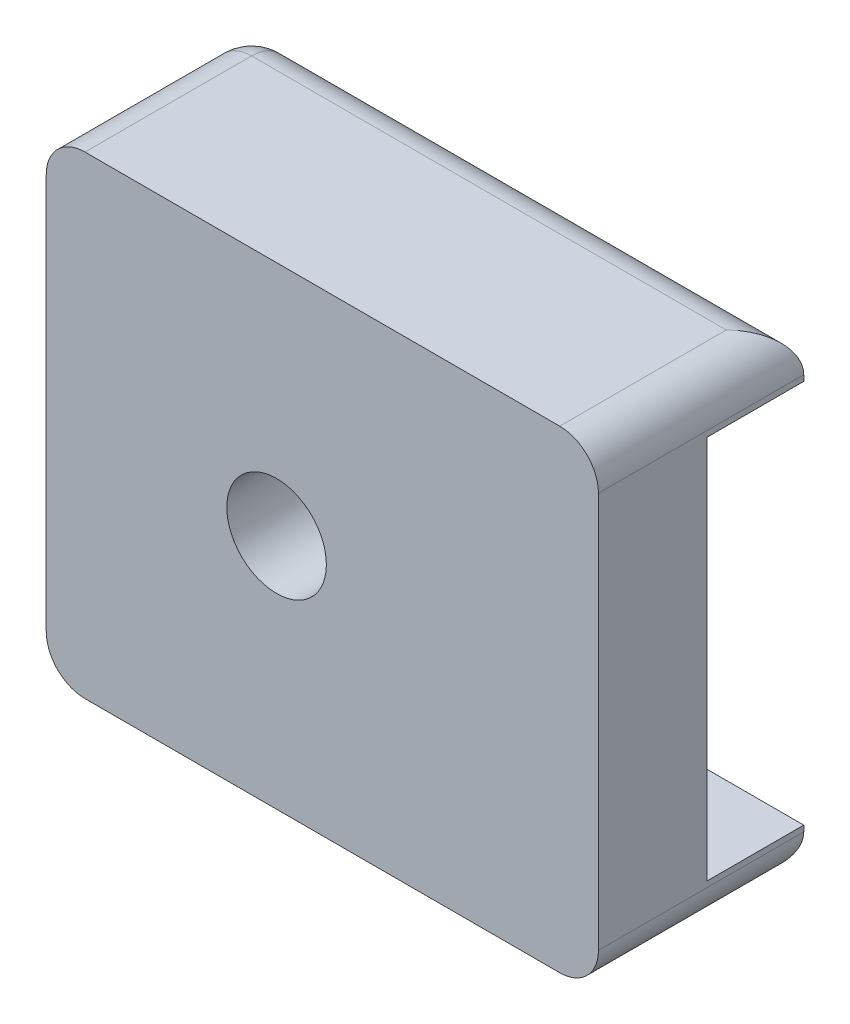
ISO-10303-21;
HEADER;
FILE_DESCRIPTION(('STEP AP214'),'2;1');
FILE_NAME('part.step','',(''),(''),'','','');
FILE_SCHEMA(('AUTOMOTIVE_DESIGN { 1 0 10303 214 1 1 1 1 }'));
ENDSEC;
DATA;
#1=APPLICATION_CONTEXT('core data for automotive mechanical design processes');
#2=APPLICATION_PROTOCOL_DEFINITION('international standard','automotive_design',2000,#1);
#3=PRODUCT_CONTEXT('',#1,'mechanical');
#4=PRODUCT('Part','Part','',(#3));
#5=PRODUCT_RELATED_PRODUCT_CATEGORY('part','',(#4));
#6=PRODUCT_DEFINITION_FORMATION('','',#4);
#7=PRODUCT_DEFINITION_CONTEXT('part definition',#1,'design');
#8=PRODUCT_DEFINITION('design','',#6,#7);
#9=PRODUCT_DEFINITION_SHAPE('','',#8);
#10=(LENGTH_UNIT() NAMED_UNIT(*) SI_UNIT(.MILLI.,.METRE.));
#11=(NAMED_UNIT(*) PLANE_ANGLE_UNIT() SI_UNIT($,.RADIAN.));
#12=(NAMED_UNIT(*) SI_UNIT($,.STERADIAN.) SOLID_ANGLE_UNIT());
#13=UNCERTAINTY_MEASURE_WITH_UNIT(LENGTH_MEASURE(1.E-05),#10,'distance_accuracy_value','');
#14=(GEOMETRIC_REPRESENTATION_CONTEXT(3) GLOBAL_UNCERTAINTY_ASSIGNED_CONTEXT((#13)) GLOBAL_UNIT_ASSIGNED_CONTEXT((#10,
#11,#12)) REPRESENTATION_CONTEXT('',''));
#15=CARTESIAN_POINT('',(0.,0.,0.));
#16=DIRECTION('',(0.,0.,1.));
#17=DIRECTION('',(1.,0.,0.));
#18=AXIS2_PLACEMENT_3D('',#15,#16,#17);
#19=CARTESIAN_POINT('',(0.,0.,0.));
#20=DIRECTION('',(0.,0.,1.));
#21=DIRECTION('',(1.,0.,0.));
#22=AXIS2_PLACEMENT_3D('',#19,#20,#21);
#23=PLANE('',#22);
#24=CARTESIAN_POINT('',(-51.5778686449145,-7.08911639926517,0.));
#25=DIRECTION('',(0.,0.,1.));
#26=DIRECTION('',(1.,0.,0.));
#27=AXIS2_PLACEMENT_3D('',#24,#25,#26);
#28=CIRCLE('',#27,3.2639);
#29=CARTESIAN_POINT('',(-48.3139686449145,-7.08911639926517,0.));
#30=VERTEX_POINT('',#29);
#31=EDGE_CURVE('E167',#30,#30,#28,.T.);
#32=ORIENTED_EDGE('',*,*,#31,.T.);
#33=EDGE_LOOP('',(#32));
#34=FACE_BOUND('',#33,.T.);
#35=DIRECTION('',(1.,0.,0.));
#36=VECTOR('',#35,1.);
#37=CARTESIAN_POINT('',(-63.7540000000007,-19.6817902232354,0.));
#38=LINE('',#37,#36);
#39=CARTESIAN_POINT('',(-63.7540000000007,-19.6817902232354,0.));
#40=VERTEX_POINT('',#39);
#41=CARTESIAN_POINT('',(-30.4800000000003,-19.6817902232354,0.));
#42=VERTEX_POINT('',#41);
#43=EDGE_CURVE('E134',#40,#42,#38,.T.);
#44=ORIENTED_EDGE('',*,*,#43,.F.);
#45=DIRECTION('',(0.,-1.,0.));
#46=VECTOR('',#45,1.);
#47=CARTESIAN_POINT('',(-63.7540000000007,5.50355742470478,0.));
#48=LINE('',#47,#46);
#49=CARTESIAN_POINT('',(-63.7540000000007,5.50355742470478,0.));
#50=VERTEX_POINT('',#49);
#51=EDGE_CURVE('E128',#50,#40,#48,.T.);
#52=ORIENTED_EDGE('',*,*,#51,.F.);
#53=DIRECTION('',(-1.,0.,0.));
#54=VECTOR('',#53,1.);
#55=CARTESIAN_POINT('',(-30.4800000000003,5.50355742470478,0.));
#56=LINE('',#55,#54);
#57=CARTESIAN_POINT('',(-30.4800000000003,5.50355742470478,0.));
#58=VERTEX_POINT('',#57);
#59=EDGE_CURVE('E131',#58,#50,#56,.T.);
#60=ORIENTED_EDGE('',*,*,#59,.F.);
#61=DIRECTION('',(0.,1.,0.));
#62=VECTOR('',#61,1.);
#63=CARTESIAN_POINT('',(-30.4800000000003,8.42455742470495,0.));
#64=LINE('',#63,#62);
#65=EDGE_CURVE('E166',#42,#58,#64,.T.);
#66=ORIENTED_EDGE('',*,*,#65,.F.);
#67=EDGE_LOOP('',(#44,#52,#60,#66));
#68=FACE_BOUND('',#67,.T.);
#69=ADVANCED_FACE('F32',(#34,#68),#23,.F.);
#70=CARTESIAN_POINT('',(0.,0.,7.10692));
#71=DIRECTION('',(0.,0.,1.));
#72=DIRECTION('',(1.,0.,0.));
#73=AXIS2_PLACEMENT_3D('',#70,#71,#72);
#74=PLANE('',#73);
#75=DIRECTION('',(0.,1.,0.));
#76=VECTOR('',#75,1.);
#77=CARTESIAN_POINT('',(-30.4800000000003,8.42455742470495,7.10692));
#78=LINE('',#77,#76);
#79=CARTESIAN_POINT('',(-30.4800000000003,-20.0627902232353,7.10692));
#80=VERTEX_POINT('',#79);
#81=CARTESIAN_POINT('',(-30.4800000000003,5.88455742470495,7.10692));
#82=VERTEX_POINT('',#81);
#83=EDGE_CURVE('E176',#80,#82,#78,.T.);
#84=ORIENTED_EDGE('',*,*,#83,.T.);
#85=CARTESIAN_POINT('',(-33.0200000000003,5.88455742470495,7.10692));
#86=DIRECTION('',(0.,0.,1.));
#87=DIRECTION('',(1.,0.,0.));
#88=AXIS2_PLACEMENT_3D('',#85,#86,#87);
#89=CIRCLE('',#88,2.54);
#90=CARTESIAN_POINT('',(-33.0200000000003,8.42455742470495,7.10692));
#91=VERTEX_POINT('',#90);
#92=EDGE_CURVE('E11',#82,#91,#89,.T.);
#93=ORIENTED_EDGE('',*,*,#92,.T.);
#94=DIRECTION('',(-1.,0.,0.));
#95=VECTOR('',#94,1.);
#96=CARTESIAN_POINT('',(-66.6749999999996,8.42455742470495,7.10692));
#97=LINE('',#96,#95);
#98=CARTESIAN_POINT('',(-64.1349999999996,8.42455742470495,7.10692));
#99=VERTEX_POINT('',#98);
#100=EDGE_CURVE('E178',#91,#99,#97,.T.);
#101=ORIENTED_EDGE('',*,*,#100,.T.);
#102=CARTESIAN_POINT('',(-64.1349999999996,5.88455742470495,7.10692));
#103=DIRECTION('',(0.,0.,1.));
#104=DIRECTION('',(1.,0.,0.));
#105=AXIS2_PLACEMENT_3D('',#102,#103,#104);
#106=CIRCLE('',#105,2.54);
#107=CARTESIAN_POINT('',(-66.6749999999996,5.88455742470495,7.10692));
#108=VERTEX_POINT('',#107);
#109=EDGE_CURVE('E210',#99,#108,#106,.T.);
#110=ORIENTED_EDGE('',*,*,#109,.T.);
#111=DIRECTION('',(0.,-1.,0.));
#112=VECTOR('',#111,1.);
#113=CARTESIAN_POINT('',(-66.6749999999996,8.42455742470495,7.10692));
#114=LINE('',#113,#112);
#115=CARTESIAN_POINT('',(-66.6749999999996,-20.0627902232353,7.10692));
#116=VERTEX_POINT('',#115);
#117=EDGE_CURVE('E171',#108,#116,#114,.T.);
#118=ORIENTED_EDGE('',*,*,#117,.T.);
#119=CARTESIAN_POINT('',(-64.1349999999996,-20.0627902232353,7.10692));
#120=DIRECTION('',(0.,0.,1.));
#121=DIRECTION('',(1.,0.,0.));
#122=AXIS2_PLACEMENT_3D('',#119,#120,#121);
#123=CIRCLE('',#122,2.54);
#124=CARTESIAN_POINT('',(-64.1349999999996,-22.6027902232353,7.10692));
#125=VERTEX_POINT('',#124);
#126=EDGE_CURVE('E212',#116,#125,#123,.T.);
#127=ORIENTED_EDGE('',*,*,#126,.T.);
#128=DIRECTION('',(1.,0.,0.));
#129=VECTOR('',#128,1.);
#130=CARTESIAN_POINT('',(-66.6749999999996,-22.6027902232353,7.10692));
#131=LINE('',#130,#129);
#132=CARTESIAN_POINT('',(-33.0200000000003,-22.6027902232353,7.10692));
#133=VERTEX_POINT('',#132);
#134=EDGE_CURVE('E174',#125,#133,#131,.T.);
#135=ORIENTED_EDGE('',*,*,#134,.T.);
#136=CARTESIAN_POINT('',(-33.0200000000003,-20.0627902232353,7.10692));
#137=DIRECTION('',(0.,0.,1.));
#138=DIRECTION('',(1.,0.,0.));
#139=AXIS2_PLACEMENT_3D('',#136,#137,#138);
#140=CIRCLE('',#139,2.54);
#141=EDGE_CURVE('E41',#133,#80,#140,.T.);
#142=ORIENTED_EDGE('',*,*,#141,.T.);
#143=EDGE_LOOP('',(#84,#93,#101,#110,#118,#127,#135,#142));
#144=FACE_BOUND('',#143,.T.);
#145=CARTESIAN_POINT('',(-51.5778686449145,-7.08911639926517,7.10692));
#146=DIRECTION('',(0.,0.,1.));
#147=DIRECTION('',(1.,0.,0.));
#148=AXIS2_PLACEMENT_3D('',#145,#146,#147);
#149=CIRCLE('',#148,3.2639);
#150=CARTESIAN_POINT('',(-48.3139686449145,-7.08911639926517,7.10692));
#151=VERTEX_POINT('',#150);
#152=EDGE_CURVE('E163',#151,#151,#149,.T.);
#153=ORIENTED_EDGE('',*,*,#152,.F.);
#154=EDGE_LOOP('',(#153));
#155=FACE_BOUND('',#154,.T.);
#156=ADVANCED_FACE('F248',(#144,#155),#74,.T.);
#157=CARTESIAN_POINT('',(-66.6749999999996,8.42455742470495,7.10692));
#158=DIRECTION('',(1.,0.,0.));
#159=DIRECTION('',(0.,0.,-1.));
#160=AXIS2_PLACEMENT_3D('',#157,#158,#159);
#161=PLANE('',#160);
#162=DIRECTION('',(0.,-1.,0.));
#163=VECTOR('',#162,1.);
#164=CARTESIAN_POINT('',(-66.6749999999996,8.42455742470495,-3.81000000000045));
#165=LINE('',#164,#163);
#166=CARTESIAN_POINT('',(-66.6749999999996,5.88455742470495,-3.81000000000045));
#167=VERTEX_POINT('',#166);
#168=CARTESIAN_POINT('',(-66.6749999999996,-20.0627902232353,-3.81000000000045));
#169=VERTEX_POINT('',#168);
#170=EDGE_CURVE('E184',#167,#169,#165,.T.);
#171=ORIENTED_EDGE('',*,*,#170,.T.);
#172=DIRECTION('',(0.,0.,-1.));
#173=VECTOR('',#172,1.);
#174=CARTESIAN_POINT('',(-66.6749999999996,-20.0627902232353,7.10692));
#175=LINE('',#174,#173);
#176=EDGE_CURVE('E187',#169,#116,#175,.F.);
#177=ORIENTED_EDGE('',*,*,#176,.T.);
#178=ORIENTED_EDGE('',*,*,#117,.F.);
#179=DIRECTION('',(0.,0.,-1.));
#180=VECTOR('',#179,1.);
#181=CARTESIAN_POINT('',(-66.6749999999996,5.88455742470495,7.10692));
#182=LINE('',#181,#180);
#183=EDGE_CURVE('E181',#108,#167,#182,.T.);
#184=ORIENTED_EDGE('',*,*,#183,.T.);
#185=EDGE_LOOP('',(#171,#177,#178,#184));
#186=FACE_BOUND('',#185,.T.);
#187=ADVANCED_FACE('F267',(#186),#161,.F.);
#188=CARTESIAN_POINT('',(-66.6749999999996,-22.6027902232353,7.10692));
#189=DIRECTION('',(0.,1.,0.));
#190=DIRECTION('',(0.,0.,1.));
#191=AXIS2_PLACEMENT_3D('',#188,#189,#190);
#192=PLANE('',#191);
#193=DIRECTION('',(1.,0.,0.));
#194=VECTOR('',#193,1.);
#195=CARTESIAN_POINT('',(-66.6749999999995,-22.6027902232353,-3.81000000000047));
#196=LINE('',#195,#194);
#197=CARTESIAN_POINT('',(-64.1349999999996,-22.6027902232353,-3.81000000000045));
#198=VERTEX_POINT('',#197);
#199=CARTESIAN_POINT('',(-33.0200000000003,-22.6027902232353,-3.81000000000022));
#200=VERTEX_POINT('',#199);
#201=EDGE_CURVE('E203',#198,#200,#196,.T.);
#202=ORIENTED_EDGE('',*,*,#201,.T.);
#203=DIRECTION('',(0.,0.,-1.));
#204=VECTOR('',#203,1.);
#205=CARTESIAN_POINT('',(-33.0200000000003,-22.6027902232353,7.10692));
#206=LINE('',#205,#204);
#207=EDGE_CURVE('E205',#200,#133,#206,.F.);
#208=ORIENTED_EDGE('',*,*,#207,.T.);
#209=ORIENTED_EDGE('',*,*,#134,.F.);
#210=DIRECTION('',(0.,0.,-1.));
#211=VECTOR('',#210,1.);
#212=CARTESIAN_POINT('',(-64.1349999999996,-22.6027902232353,7.10692));
#213=LINE('',#212,#211);
#214=EDGE_CURVE('E201',#125,#198,#213,.T.);
#215=ORIENTED_EDGE('',*,*,#214,.T.);
#216=EDGE_LOOP('',(#202,#208,#209,#215));
#217=FACE_BOUND('',#216,.T.);
#218=ADVANCED_FACE('F277',(#217),#192,.F.);
#219=CARTESIAN_POINT('',(-30.4800000000003,8.42455742470495,7.10692));
#220=DIRECTION('',(-1.,0.,0.));
#221=DIRECTION('',(0.,-1.,0.));
#222=AXIS2_PLACEMENT_3D('',#219,#220,#221);
#223=PLANE('',#222);
#224=DIRECTION('',(0.,1.,0.));
#225=VECTOR('',#224,1.);
#226=CARTESIAN_POINT('',(-30.4800000000003,8.42455742470496,-6.3500000000002));
#227=LINE('',#226,#225);
#228=CARTESIAN_POINT('',(-30.4800000000003,5.50355742470478,-6.35000000000021));
#229=VERTEX_POINT('',#228);
#230=CARTESIAN_POINT('',(-30.4800000000003,5.88455742470495,-6.3500000000002));
#231=VERTEX_POINT('',#230);
#232=EDGE_CURVE('E472',#229,#231,#227,.T.);
#233=ORIENTED_EDGE('',*,*,#232,.T.);
#234=DIRECTION('',(0.,0.,-1.));
#235=VECTOR('',#234,1.);
#236=CARTESIAN_POINT('',(-30.4800000000003,5.88455742470495,7.10692));
#237=LINE('',#236,#235);
#238=EDGE_CURVE('E49',#231,#82,#237,.F.);
#239=ORIENTED_EDGE('',*,*,#238,.T.);
#240=ORIENTED_EDGE('',*,*,#83,.F.);
#241=DIRECTION('',(0.,0.,-1.));
#242=VECTOR('',#241,1.);
#243=CARTESIAN_POINT('',(-30.4800000000003,-20.0627902232353,7.10692));
#244=LINE('',#243,#242);
#245=CARTESIAN_POINT('',(-30.4800000000003,-20.0627902232353,-6.35000000000021));
#246=VERTEX_POINT('',#245);
#247=EDGE_CURVE('E207',#80,#246,#244,.T.);
#248=ORIENTED_EDGE('',*,*,#247,.T.);
#249=DIRECTION('',(0.,1.,0.));
#250=VECTOR('',#249,1.);
#251=CARTESIAN_POINT('',(-30.4800000000003,-19.6817902232354,-6.35000000000021));
#252=LINE('',#251,#250);
#253=CARTESIAN_POINT('',(-30.4800000000003,-19.6817902232354,-6.35000000000021));
#254=VERTEX_POINT('',#253);
#255=EDGE_CURVE('E468',#246,#254,#252,.T.);
#256=ORIENTED_EDGE('',*,*,#255,.T.);
#257=DIRECTION('',(0.,0.,1.));
#258=VECTOR('',#257,1.);
#259=CARTESIAN_POINT('',(-30.4800000000003,-19.6817902232354,-54.0236229697945));
#260=LINE('',#259,#258);
#261=EDGE_CURVE('E158',#254,#42,#260,.T.);
#262=ORIENTED_EDGE('',*,*,#261,.T.);
#263=ORIENTED_EDGE('',*,*,#65,.T.);
#264=DIRECTION('',(0.,0.,1.));
#265=VECTOR('',#264,1.);
#266=CARTESIAN_POINT('',(-30.4800000000003,5.50355742470478,-54.0236229697945));
#267=LINE('',#266,#265);
#268=EDGE_CURVE('E147',#229,#58,#267,.T.);
#269=ORIENTED_EDGE('',*,*,#268,.F.);
#270=EDGE_LOOP('',(#233,#239,#240,#248,#256,#262,#263,#269));
#271=FACE_BOUND('',#270,.T.);
#272=ADVANCED_FACE('F304',(#271),#223,.F.);
#273=CARTESIAN_POINT('',(-66.6749999999996,8.42455742470495,7.10692));
#274=DIRECTION('',(0.,-1.,0.));
#275=DIRECTION('',(0.,0.,-1.));
#276=AXIS2_PLACEMENT_3D('',#273,#274,#275);
#277=PLANE('',#276);
#278=ORIENTED_EDGE('',*,*,#100,.F.);
#279=DIRECTION('',(0.,0.,-1.));
#280=VECTOR('',#279,1.);
#281=CARTESIAN_POINT('',(-33.0200000000003,8.42455742470495,7.10692));
#282=LINE('',#281,#280);
#283=CARTESIAN_POINT('',(-33.0200000000003,8.42455742470495,-3.81000000000023));
#284=VERTEX_POINT('',#283);
#285=EDGE_CURVE('E199',#91,#284,#282,.T.);
#286=ORIENTED_EDGE('',*,*,#285,.T.);
#287=DIRECTION('',(-1.,0.,0.));
#288=VECTOR('',#287,1.);
#289=CARTESIAN_POINT('',(-66.6749999999995,8.42455742470495,-3.81000000000047));
#290=LINE('',#289,#288);
#291=CARTESIAN_POINT('',(-64.1349999999996,8.42455742470495,-3.81000000000045));
#292=VERTEX_POINT('',#291);
#293=EDGE_CURVE('E197',#284,#292,#290,.T.);
#294=ORIENTED_EDGE('',*,*,#293,.T.);
#295=DIRECTION('',(0.,0.,-1.));
#296=VECTOR('',#295,1.);
#297=CARTESIAN_POINT('',(-64.1349999999996,8.42455742470495,7.10692));
#298=LINE('',#297,#296);
#299=EDGE_CURVE('E195',#292,#99,#298,.F.);
#300=ORIENTED_EDGE('',*,*,#299,.T.);
#301=EDGE_LOOP('',(#278,#286,#294,#300));
#302=FACE_BOUND('',#301,.T.);
#303=ADVANCED_FACE('F252',(#302),#277,.F.);
#304=CARTESIAN_POINT('',(-51.5778686449145,-7.08911639926517,7.10692));
#305=DIRECTION('',(0.,0.,-1.));
#306=DIRECTION('',(-1.,0.,0.));
#307=AXIS2_PLACEMENT_3D('',#304,#305,#306);
#308=CYLINDRICAL_SURFACE('',#307,3.2639);
#309=ORIENTED_EDGE('',*,*,#152,.T.);
#310=EDGE_LOOP('',(#309));
#311=FACE_BOUND('',#310,.T.);
#312=ORIENTED_EDGE('',*,*,#31,.F.);
#313=EDGE_LOOP('',(#312));
#314=FACE_BOUND('',#313,.T.);
#315=ADVANCED_FACE('F303',(#311,#314),#308,.F.);
#316=CARTESIAN_POINT('',(-63.7540000000007,5.50355742470478,-54.0236229697945));
#317=DIRECTION('',(-1.,0.,0.));
#318=DIRECTION('',(0.,0.,1.));
#319=AXIS2_PLACEMENT_3D('',#316,#317,#318);
#320=PLANE('',#319);
#321=DIRECTION('',(0.,0.,1.));
#322=VECTOR('',#321,1.);
#323=CARTESIAN_POINT('',(-63.7540000000007,-19.6817902232354,-54.0236229697945));
#324=LINE('',#323,#322);
#325=CARTESIAN_POINT('',(-63.7540000000007,-19.6817902232354,-6.35000000000045));
#326=VERTEX_POINT('',#325);
#327=EDGE_CURVE('E138',#326,#40,#324,.T.);
#328=ORIENTED_EDGE('',*,*,#327,.F.);
#329=DIRECTION('',(0.,1.,0.));
#330=VECTOR('',#329,1.);
#331=CARTESIAN_POINT('',(-63.7540000000007,5.50355742470478,-6.35000000000045));
#332=LINE('',#331,#330);
#333=CARTESIAN_POINT('',(-63.7540000000007,5.50355742470478,-6.35000000000045));
#334=VERTEX_POINT('',#333);
#335=EDGE_CURVE('E144',#326,#334,#332,.T.);
#336=ORIENTED_EDGE('',*,*,#335,.T.);
#337=DIRECTION('',(0.,0.,1.));
#338=VECTOR('',#337,1.);
#339=CARTESIAN_POINT('',(-63.7540000000007,5.50355742470478,-54.0236229697945));
#340=LINE('',#339,#338);
#341=EDGE_CURVE('E142',#334,#50,#340,.T.);
#342=ORIENTED_EDGE('',*,*,#341,.T.);
#343=ORIENTED_EDGE('',*,*,#51,.T.);
#344=EDGE_LOOP('',(#328,#336,#342,#343));
#345=FACE_BOUND('',#344,.T.);
#346=ADVANCED_FACE('F143',(#345),#320,.F.);
#347=CARTESIAN_POINT('',(-30.4800000000003,5.50355742470478,-54.0236229697945));
#348=DIRECTION('',(0.,1.,0.));
#349=DIRECTION('',(0.,0.,1.));
#350=AXIS2_PLACEMENT_3D('',#347,#348,#349);
#351=PLANE('',#350);
#352=ORIENTED_EDGE('',*,*,#341,.F.);
#353=DIRECTION('',(1.,0.,0.));
#354=VECTOR('',#353,1.);
#355=CARTESIAN_POINT('',(-30.4800000000007,5.50355742470478,-6.35000000000021));
#356=LINE('',#355,#354);
#357=EDGE_CURVE('E162',#334,#229,#356,.T.);
#358=ORIENTED_EDGE('',*,*,#357,.T.);
#359=ORIENTED_EDGE('',*,*,#268,.T.);
#360=ORIENTED_EDGE('',*,*,#59,.T.);
#361=EDGE_LOOP('',(#352,#358,#359,#360));
#362=FACE_BOUND('',#361,.T.);
#363=ADVANCED_FACE('F150',(#362),#351,.F.);
#364=CARTESIAN_POINT('',(-63.7540000000007,-19.6817902232354,-54.0236229697945));
#365=DIRECTION('',(0.,-1.,0.));
#366=DIRECTION('',(1.,0.,0.));
#367=AXIS2_PLACEMENT_3D('',#364,#365,#366);
#368=PLANE('',#367);
#369=ORIENTED_EDGE('',*,*,#261,.F.);
#370=DIRECTION('',(-1.,0.,0.));
#371=VECTOR('',#370,1.);
#372=CARTESIAN_POINT('',(-63.7540000000011,-19.6817902232354,-6.35000000000045));
#373=LINE('',#372,#371);
#374=EDGE_CURVE('E170',#254,#326,#373,.T.);
#375=ORIENTED_EDGE('',*,*,#374,.T.);
#376=ORIENTED_EDGE('',*,*,#327,.T.);
#377=ORIENTED_EDGE('',*,*,#43,.T.);
#378=EDGE_LOOP('',(#369,#375,#376,#377));
#379=FACE_BOUND('',#378,.T.);
#380=ADVANCED_FACE('F345',(#379),#368,.F.);
#381=CARTESIAN_POINT('',(-63.5000000000007,40.5697611487876,-6.35000000000045));
#382=DIRECTION('',(0.,0.,1.));
#383=DIRECTION('',(0.,1.,0.));
#384=AXIS2_PLACEMENT_3D('',#381,#382,#383);
#385=PLANE('',#384);
#386=DIRECTION('',(0.,-1.,0.));
#387=VECTOR('',#386,1.);
#388=CARTESIAN_POINT('',(-64.1349999999995,40.5697611487876,-6.35000000000046));
#389=LINE('',#388,#387);
#390=CARTESIAN_POINT('',(-64.1349999999995,-20.0627902232353,-6.35000000000045));
#391=VERTEX_POINT('',#390);
#392=CARTESIAN_POINT('',(-64.1349999999995,5.88455742470495,-6.35000000000045));
#393=VERTEX_POINT('',#392);
#394=EDGE_CURVE('E191',#391,#393,#389,.F.);
#395=ORIENTED_EDGE('',*,*,#394,.T.);
#396=DIRECTION('',(-1.,0.,0.));
#397=VECTOR('',#396,1.);
#398=CARTESIAN_POINT('',(-63.5000000000007,5.88455742470495,-6.35000000000045));
#399=LINE('',#398,#397);
#400=EDGE_CURVE('E193',#393,#231,#399,.F.);
#401=ORIENTED_EDGE('',*,*,#400,.T.);
#402=ORIENTED_EDGE('',*,*,#232,.F.);
#403=ORIENTED_EDGE('',*,*,#357,.F.);
#404=ORIENTED_EDGE('',*,*,#335,.F.);
#405=ORIENTED_EDGE('',*,*,#374,.F.);
#406=ORIENTED_EDGE('',*,*,#255,.F.);
#407=DIRECTION('',(1.,0.,0.));
#408=VECTOR('',#407,1.);
#409=CARTESIAN_POINT('',(-63.5000000000007,-20.0627902232353,-6.35000000000044));
#410=LINE('',#409,#408);
#411=EDGE_CURVE('E189',#246,#391,#410,.F.);
#412=ORIENTED_EDGE('',*,*,#411,.T.);
#413=EDGE_LOOP('',(#395,#401,#402,#403,#404,#405,#406,#412));
#414=FACE_BOUND('',#413,.T.);
#415=ADVANCED_FACE('F352',(#414),#385,.F.);
#416=CARTESIAN_POINT('',(-33.0200000000003,5.88455742470495,7.10692));
#417=DIRECTION('',(0.,0.,-1.));
#418=DIRECTION('',(-1.,0.,0.));
#419=AXIS2_PLACEMENT_3D('',#416,#417,#418);
#420=CYLINDRICAL_SURFACE('',#419,2.54);
#421=ORIENTED_EDGE('',*,*,#92,.F.);
#422=ORIENTED_EDGE('',*,*,#238,.F.);
#423=CARTESIAN_POINT('',(-33.0200000000003,5.88455742470495,-3.81000000000023));
#424=DIRECTION('',(-0.707106781186545,0.,-0.70710678118655));
#425=DIRECTION('',(0.70710678118655,0.,-0.707106781186545));
#426=AXIS2_PLACEMENT_3D('',#423,#424,#425);
#427=ELLIPSE('',#426,3.59210244842765,2.54);
#428=EDGE_CURVE('E36',#284,#231,#427,.T.);
#429=ORIENTED_EDGE('',*,*,#428,.F.);
#430=ORIENTED_EDGE('',*,*,#285,.F.);
#431=EDGE_LOOP('',(#421,#422,#429,#430));
#432=FACE_BOUND('',#431,.T.);
#433=ADVANCED_FACE('F34',(#432),#420,.T.);
#434=CARTESIAN_POINT('',(-33.0200000000003,-20.0627902232353,7.10692));
#435=DIRECTION('',(0.,0.,-1.));
#436=DIRECTION('',(-1.,0.,0.));
#437=AXIS2_PLACEMENT_3D('',#434,#435,#436);
#438=CYLINDRICAL_SURFACE('',#437,2.54);
#439=ORIENTED_EDGE('',*,*,#141,.F.);
#440=ORIENTED_EDGE('',*,*,#207,.F.);
#441=CARTESIAN_POINT('',(-33.0200000000003,-20.0627902232353,-3.81000000000022));
#442=DIRECTION('',(-0.707106781186545,0.,-0.70710678118655));
#443=DIRECTION('',(0.70710678118655,0.,-0.707106781186545));
#444=AXIS2_PLACEMENT_3D('',#441,#442,#443);
#445=ELLIPSE('',#444,3.59210244842765,2.54);
#446=EDGE_CURVE('E231',#246,#200,#445,.T.);
#447=ORIENTED_EDGE('',*,*,#446,.F.);
#448=ORIENTED_EDGE('',*,*,#247,.F.);
#449=EDGE_LOOP('',(#439,#440,#447,#448));
#450=FACE_BOUND('',#449,.T.);
#451=ADVANCED_FACE('F365',(#450),#438,.T.);
#452=CARTESIAN_POINT('',(-66.6749999999995,5.88455742470495,-3.81000000000047));
#453=DIRECTION('',(-1.,0.,0.));
#454=DIRECTION('',(0.,0.,1.));
#455=AXIS2_PLACEMENT_3D('',#452,#453,#454);
#456=CYLINDRICAL_SURFACE('',#455,2.54);
#457=ORIENTED_EDGE('',*,*,#428,.T.);
#458=ORIENTED_EDGE('',*,*,#400,.F.);
#459=CARTESIAN_POINT('',(-64.1349999999996,5.88455742470495,-3.81000000000045));
#460=DIRECTION('',(-1.,0.,0.));
#461=DIRECTION('',(0.,0.,1.));
#462=AXIS2_PLACEMENT_3D('',#459,#460,#461);
#463=CIRCLE('',#462,2.54);
#464=EDGE_CURVE('E229',#292,#393,#463,.T.);
#465=ORIENTED_EDGE('',*,*,#464,.F.);
#466=ORIENTED_EDGE('',*,*,#293,.F.);
#467=EDGE_LOOP('',(#457,#458,#465,#466));
#468=FACE_BOUND('',#467,.T.);
#469=ADVANCED_FACE('F242',(#468),#456,.T.);
#470=CARTESIAN_POINT('',(-64.1349999999996,5.88455742470495,7.10692));
#471=DIRECTION('',(0.,0.,-1.));
#472=DIRECTION('',(-1.,0.,0.));
#473=AXIS2_PLACEMENT_3D('',#470,#471,#472);
#474=CYLINDRICAL_SURFACE('',#473,2.54);
#475=ORIENTED_EDGE('',*,*,#109,.F.);
#476=ORIENTED_EDGE('',*,*,#299,.F.);
#477=CARTESIAN_POINT('',(-64.1349999999996,5.88455742470495,-3.81000000000045));
#478=DIRECTION('',(0.,0.,-1.));
#479=DIRECTION('',(0.,1.,0.));
#480=AXIS2_PLACEMENT_3D('',#477,#478,#479);
#481=CIRCLE('',#480,2.54);
#482=EDGE_CURVE('E226',#167,#292,#481,.T.);
#483=ORIENTED_EDGE('',*,*,#482,.F.);
#484=ORIENTED_EDGE('',*,*,#183,.F.);
#485=EDGE_LOOP('',(#475,#476,#483,#484));
#486=FACE_BOUND('',#485,.T.);
#487=ADVANCED_FACE('F256',(#486),#474,.T.);
#488=CARTESIAN_POINT('',(-64.1349999999996,-20.0627902232353,7.10692));
#489=DIRECTION('',(0.,0.,-1.));
#490=DIRECTION('',(-1.,0.,0.));
#491=AXIS2_PLACEMENT_3D('',#488,#489,#490);
#492=CYLINDRICAL_SURFACE('',#491,2.54);
#493=ORIENTED_EDGE('',*,*,#126,.F.);
#494=ORIENTED_EDGE('',*,*,#176,.F.);
#495=CARTESIAN_POINT('',(-64.1349999999996,-20.0627902232353,-3.81000000000045));
#496=DIRECTION('',(0.,0.,-1.));
#497=DIRECTION('',(-1.,0.,0.));
#498=AXIS2_PLACEMENT_3D('',#495,#496,#497);
#499=CIRCLE('',#498,2.54);
#500=EDGE_CURVE('E223',#198,#169,#499,.T.);
#501=ORIENTED_EDGE('',*,*,#500,.F.);
#502=ORIENTED_EDGE('',*,*,#214,.F.);
#503=EDGE_LOOP('',(#493,#494,#501,#502));
#504=FACE_BOUND('',#503,.T.);
#505=ADVANCED_FACE('F274',(#504),#492,.T.);
#506=CARTESIAN_POINT('',(-66.6749999999995,-20.0627902232353,-3.81000000000047));
#507=DIRECTION('',(1.,0.,0.));
#508=DIRECTION('',(0.,0.,-1.));
#509=AXIS2_PLACEMENT_3D('',#506,#507,#508);
#510=CYLINDRICAL_SURFACE('',#509,2.54);
#511=ORIENTED_EDGE('',*,*,#446,.T.);
#512=ORIENTED_EDGE('',*,*,#201,.F.);
#513=CARTESIAN_POINT('',(-64.1349999999996,-20.0627902232353,-3.81000000000045));
#514=DIRECTION('',(-1.,0.,0.));
#515=DIRECTION('',(0.,0.,1.));
#516=AXIS2_PLACEMENT_3D('',#513,#514,#515);
#517=CIRCLE('',#516,2.54);
#518=EDGE_CURVE('E220',#391,#198,#517,.T.);
#519=ORIENTED_EDGE('',*,*,#518,.F.);
#520=ORIENTED_EDGE('',*,*,#411,.F.);
#521=EDGE_LOOP('',(#511,#512,#519,#520));
#522=FACE_BOUND('',#521,.T.);
#523=ADVANCED_FACE('F280',(#522),#510,.T.);
#524=CARTESIAN_POINT('',(-64.1349999999996,5.88455742470495,-3.81000000000045));
#525=DIRECTION('',(0.,0.,1.));
#526=DIRECTION('',(1.,0.,0.));
#527=AXIS2_PLACEMENT_3D('',#524,#525,#526);
#528=SPHERICAL_SURFACE('',#527,2.54);
#529=ORIENTED_EDGE('',*,*,#482,.T.);
#530=ORIENTED_EDGE('',*,*,#464,.T.);
#531=CARTESIAN_POINT('',(-64.1349999999996,5.88455742470495,-3.81000000000045));
#532=DIRECTION('',(0.,1.,0.));
#533=DIRECTION('',(0.,0.,1.));
#534=AXIS2_PLACEMENT_3D('',#531,#532,#533);
#535=CIRCLE('',#534,2.54);
#536=EDGE_CURVE('E217',#167,#393,#535,.F.);
#537=ORIENTED_EDGE('',*,*,#536,.F.);
#538=EDGE_LOOP('',(#529,#530,#537));
#539=FACE_BOUND('',#538,.T.);
#540=ADVANCED_FACE('F260',(#539),#528,.T.);
#541=CARTESIAN_POINT('',(-64.1349999999996,-20.0627902232353,-3.81000000000045));
#542=DIRECTION('',(0.,0.,1.));
#543=DIRECTION('',(1.,0.,0.));
#544=AXIS2_PLACEMENT_3D('',#541,#542,#543);
#545=SPHERICAL_SURFACE('',#544,2.54);
#546=ORIENTED_EDGE('',*,*,#518,.T.);
#547=ORIENTED_EDGE('',*,*,#500,.T.);
#548=CARTESIAN_POINT('',(-64.1349999999996,-20.0627902232353,-3.81000000000045));
#549=DIRECTION('',(0.,-1.,0.));
#550=DIRECTION('',(0.,0.,-1.));
#551=AXIS2_PLACEMENT_3D('',#548,#549,#550);
#552=CIRCLE('',#551,2.54);
#553=EDGE_CURVE('E215',#391,#169,#552,.F.);
#554=ORIENTED_EDGE('',*,*,#553,.F.);
#555=EDGE_LOOP('',(#546,#547,#554));
#556=FACE_BOUND('',#555,.T.);
#557=ADVANCED_FACE('F283',(#556),#545,.T.);
#558=CARTESIAN_POINT('',(-64.1349999999996,8.42455742470495,-3.81000000000045));
#559=DIRECTION('',(0.,-1.,0.));
#560=DIRECTION('',(0.,0.,-1.));
#561=AXIS2_PLACEMENT_3D('',#558,#559,#560);
#562=CYLINDRICAL_SURFACE('',#561,2.54);
#563=ORIENTED_EDGE('',*,*,#536,.T.);
#564=ORIENTED_EDGE('',*,*,#394,.F.);
#565=ORIENTED_EDGE('',*,*,#553,.T.);
#566=ORIENTED_EDGE('',*,*,#170,.F.);
#567=EDGE_LOOP('',(#563,#564,#565,#566));
#568=FACE_BOUND('',#567,.T.);
#569=ADVANCED_FACE('F264',(#568),#562,.T.);
#570=CLOSED_SHELL('',(#69,#156,#187,#218,#272,#303,#315,#346,#363,#380,#415,#433,#451,#469,#487,
#505,#523,#540,#557,#569));
#571=MANIFOLD_SOLID_BREP('B2',#570);
#572=ADVANCED_BREP_SHAPE_REPRESENTATION('',(#18,#571),#14);
#573=SHAPE_DEFINITION_REPRESENTATION(#9,#572);
ENDSEC;
END-ISO-10303-21;
